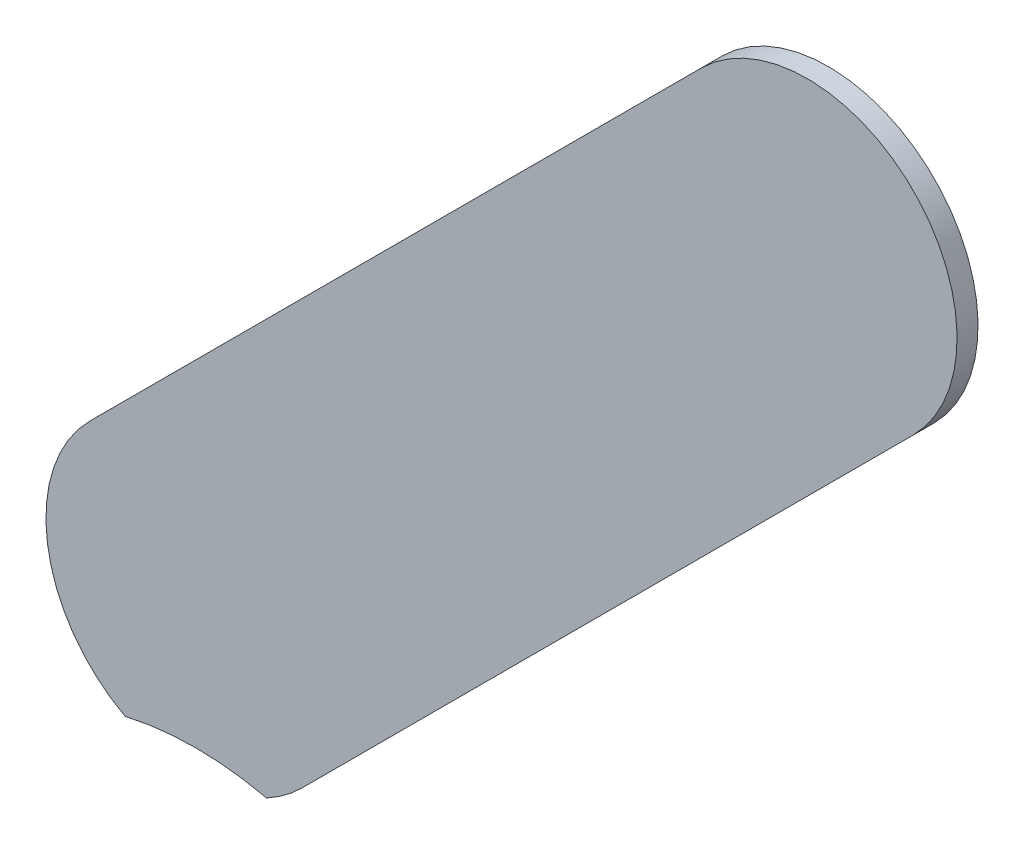
ISO-10303-21;
HEADER;
FILE_DESCRIPTION(('STEP AP214'),'2;1');
FILE_NAME('part.step','',(''),(''),'','','');
FILE_SCHEMA(('AUTOMOTIVE_DESIGN { 1 0 10303 214 1 1 1 1 }'));
ENDSEC;
DATA;
#1=APPLICATION_CONTEXT('core data for automotive mechanical design processes');
#2=APPLICATION_PROTOCOL_DEFINITION('international standard','automotive_design',2000,#1);
#3=PRODUCT_CONTEXT('',#1,'mechanical');
#4=PRODUCT('Part','Part','',(#3));
#5=PRODUCT_RELATED_PRODUCT_CATEGORY('part','',(#4));
#6=PRODUCT_DEFINITION_FORMATION('','',#4);
#7=PRODUCT_DEFINITION_CONTEXT('part definition',#1,'design');
#8=PRODUCT_DEFINITION('design','',#6,#7);
#9=PRODUCT_DEFINITION_SHAPE('','',#8);
#10=(LENGTH_UNIT() NAMED_UNIT(*) SI_UNIT(.MILLI.,.METRE.));
#11=(NAMED_UNIT(*) PLANE_ANGLE_UNIT() SI_UNIT($,.RADIAN.));
#12=(NAMED_UNIT(*) SI_UNIT($,.STERADIAN.) SOLID_ANGLE_UNIT());
#13=UNCERTAINTY_MEASURE_WITH_UNIT(LENGTH_MEASURE(1.E-05),#10,'distance_accuracy_value','');
#14=(GEOMETRIC_REPRESENTATION_CONTEXT(3) GLOBAL_UNCERTAINTY_ASSIGNED_CONTEXT((#13)) GLOBAL_UNIT_ASSIGNED_CONTEXT((#10,
#11,#12)) REPRESENTATION_CONTEXT('',''));
#15=CARTESIAN_POINT('',(0.,0.,0.));
#16=DIRECTION('',(0.,0.,1.));
#17=DIRECTION('',(1.,0.,0.));
#18=AXIS2_PLACEMENT_3D('',#15,#16,#17);
#19=CARTESIAN_POINT('',(136.9019995,-111.0019995,-0.035));
#20=DIRECTION('',(0.,0.,-1.));
#21=DIRECTION('',(-0.707106781186548,0.707106781186548,0.));
#22=AXIS2_PLACEMENT_3D('',#19,#20,#21);
#23=CYLINDRICAL_SURFACE('',#22,0.249999723809);
#24=DIRECTION('',(0.,0.,-1.));
#25=VECTOR('',#24,1.);
#26=CARTESIAN_POINT('',(136.78404401306,-111.2224226498,-0.035));
#27=LINE('',#26,#25);
#28=CARTESIAN_POINT('',(136.78404401308,-111.2224226499,0.));
#29=VERTEX_POINT('',#28);
#30=CARTESIAN_POINT('',(136.78404401308,-111.2224226499,-0.035));
#31=VERTEX_POINT('',#30);
#32=EDGE_CURVE('E27',#29,#31,#27,.T.);
#33=ORIENTED_EDGE('',*,*,#32,.F.);
#34=CARTESIAN_POINT('',(136.9019995,-111.0019995,0.));
#35=DIRECTION('',(0.,0.,1.));
#36=DIRECTION('',(-0.707106781186548,0.707106781186548,0.));
#37=AXIS2_PLACEMENT_3D('',#34,#35,#36);
#38=CIRCLE('',#37,0.249999723809);
#39=CARTESIAN_POINT('',(136.725223,-110.825223,0.));
#40=VERTEX_POINT('',#39);
#41=EDGE_CURVE('E135',#40,#29,#38,.T.);
#42=ORIENTED_EDGE('',*,*,#41,.F.);
#43=DIRECTION('',(0.,0.,1.));
#44=VECTOR('',#43,1.);
#45=CARTESIAN_POINT('',(136.725223,-110.825223,-0.035));
#46=LINE('',#45,#44);
#47=CARTESIAN_POINT('',(136.725223,-110.825223,-0.035));
#48=VERTEX_POINT('',#47);
#49=EDGE_CURVE('E11',#48,#40,#46,.T.);
#50=ORIENTED_EDGE('',*,*,#49,.F.);
#51=CARTESIAN_POINT('',(136.9019995,-111.0019995,-0.035));
#52=DIRECTION('',(0.,0.,1.));
#53=DIRECTION('',(-0.707106781186548,0.707106781186548,0.));
#54=AXIS2_PLACEMENT_3D('',#51,#52,#53);
#55=CIRCLE('',#54,0.249999723809);
#56=EDGE_CURVE('E152',#48,#31,#55,.T.);
#57=ORIENTED_EDGE('',*,*,#56,.T.);
#58=EDGE_LOOP('',(#33,#42,#50,#57));
#59=FACE_BOUND('',#58,.T.);
#60=ADVANCED_FACE('F17',(#59),#23,.T.);
#61=CARTESIAN_POINT('',(137.745223,-109.805223,-0.035));
#62=DIRECTION('',(0.707106781186548,-0.707106781186548,0.));
#63=DIRECTION('',(0.,0.,-1.));
#64=AXIS2_PLACEMENT_3D('',#61,#62,#63);
#65=PLANE('',#64);
#66=DIRECTION('',(-0.707106781186548,-0.707106781186548,0.));
#67=VECTOR('',#66,1.);
#68=CARTESIAN_POINT('',(137.745223,-109.805223,-0.035));
#69=LINE('',#68,#67);
#70=CARTESIAN_POINT('',(137.745223,-109.805223,-0.035));
#71=VERTEX_POINT('',#70);
#72=EDGE_CURVE('E136',#71,#48,#69,.T.);
#73=ORIENTED_EDGE('',*,*,#72,.T.);
#74=ORIENTED_EDGE('',*,*,#49,.T.);
#75=DIRECTION('',(-0.707106781186548,-0.707106781186548,0.));
#76=VECTOR('',#75,1.);
#77=CARTESIAN_POINT('',(137.745223,-109.805223,0.));
#78=LINE('',#77,#76);
#79=CARTESIAN_POINT('',(137.745223,-109.805223,0.));
#80=VERTEX_POINT('',#79);
#81=EDGE_CURVE('E132',#80,#40,#78,.T.);
#82=ORIENTED_EDGE('',*,*,#81,.F.);
#83=DIRECTION('',(0.,0.,1.));
#84=VECTOR('',#83,1.);
#85=CARTESIAN_POINT('',(137.745223,-109.805223,-0.035));
#86=LINE('',#85,#84);
#87=EDGE_CURVE('E129',#71,#80,#86,.T.);
#88=ORIENTED_EDGE('',*,*,#87,.F.);
#89=EDGE_LOOP('',(#73,#74,#82,#88));
#90=FACE_BOUND('',#89,.T.);
#91=ADVANCED_FACE('F19',(#90),#65,.F.);
#92=CARTESIAN_POINT('',(136.902,-111.734,-0.045));
#93=DIRECTION('',(0.,0.,-1.));
#94=DIRECTION('',(0.,-1.,0.));
#95=AXIS2_PLACEMENT_3D('',#92,#93,#94);
#96=CYLINDRICAL_SURFACE('',#95,0.525);
#97=DIRECTION('',(0.,0.,-1.));
#98=VECTOR('',#97,1.);
#99=CARTESIAN_POINT('',(137.01995528805,-111.2224224887,-0.035));
#100=LINE('',#99,#98);
#101=CARTESIAN_POINT('',(137.01995528803,-111.2224224887,0.));
#102=VERTEX_POINT('',#101);
#103=CARTESIAN_POINT('',(137.01995528803,-111.2224224887,-0.035));
#104=VERTEX_POINT('',#103);
#105=EDGE_CURVE('E93',#102,#104,#100,.T.);
#106=ORIENTED_EDGE('',*,*,#105,.F.);
#107=CARTESIAN_POINT('',(136.902,-111.734,0.));
#108=DIRECTION('',(0.,0.,-1.));
#109=DIRECTION('',(0.,-1.,0.));
#110=AXIS2_PLACEMENT_3D('',#107,#108,#109);
#111=CIRCLE('',#110,0.525);
#112=EDGE_CURVE('E144',#29,#102,#111,.T.);
#113=ORIENTED_EDGE('',*,*,#112,.F.);
#114=ORIENTED_EDGE('',*,*,#32,.T.);
#115=CARTESIAN_POINT('',(136.902,-111.734,-0.035));
#116=DIRECTION('',(0.,0.,-1.));
#117=DIRECTION('',(0.,-1.,0.));
#118=AXIS2_PLACEMENT_3D('',#115,#116,#117);
#119=CIRCLE('',#118,0.525);
#120=EDGE_CURVE('E128',#31,#104,#119,.T.);
#121=ORIENTED_EDGE('',*,*,#120,.T.);
#122=EDGE_LOOP('',(#106,#113,#114,#121));
#123=FACE_BOUND('',#122,.T.);
#124=ADVANCED_FACE('F223',(#123),#96,.F.);
#125=CARTESIAN_POINT('',(137.078776,-111.178776,0.));
#126=DIRECTION('',(0.,0.,1.));
#127=DIRECTION('',(1.,0.,0.));
#128=AXIS2_PLACEMENT_3D('',#125,#126,#127);
#129=PLANE('',#128);
#130=CARTESIAN_POINT('',(136.9019995,-111.0019995,0.));
#131=DIRECTION('',(0.,0.,1.));
#132=DIRECTION('',(-0.707106781186548,0.707106781186548,0.));
#133=AXIS2_PLACEMENT_3D('',#130,#131,#132);
#134=CIRCLE('',#133,0.249999723809);
#135=CARTESIAN_POINT('',(137.078776,-111.178776,0.));
#136=VERTEX_POINT('',#135);
#137=EDGE_CURVE('E108',#102,#136,#134,.T.);
#138=ORIENTED_EDGE('',*,*,#137,.T.);
#139=DIRECTION('',(0.707106781186548,0.707106781186548,0.));
#140=VECTOR('',#139,1.);
#141=CARTESIAN_POINT('',(137.078776,-111.178776,0.));
#142=LINE('',#141,#140);
#143=CARTESIAN_POINT('',(138.098776,-110.158776,0.));
#144=VERTEX_POINT('',#143);
#145=EDGE_CURVE('E106',#136,#144,#142,.T.);
#146=ORIENTED_EDGE('',*,*,#145,.T.);
#147=CARTESIAN_POINT('',(137.9219995,-109.9819995,0.));
#148=DIRECTION('',(0.,0.,1.));
#149=DIRECTION('',(0.707106781186548,-0.707106781186548,0.));
#150=AXIS2_PLACEMENT_3D('',#147,#148,#149);
#151=CIRCLE('',#150,0.249999723809);
#152=EDGE_CURVE('E124',#144,#80,#151,.T.);
#153=ORIENTED_EDGE('',*,*,#152,.T.);
#154=ORIENTED_EDGE('',*,*,#81,.T.);
#155=ORIENTED_EDGE('',*,*,#41,.T.);
#156=ORIENTED_EDGE('',*,*,#112,.T.);
#157=EDGE_LOOP('',(#138,#146,#153,#154,#155,#156));
#158=FACE_BOUND('',#157,.T.);
#159=ADVANCED_FACE('F215',(#158),#129,.T.);
#160=CARTESIAN_POINT('',(137.078776,-111.178776,-0.035));
#161=DIRECTION('',(0.,0.,1.));
#162=DIRECTION('',(1.,0.,0.));
#163=AXIS2_PLACEMENT_3D('',#160,#161,#162);
#164=PLANE('',#163);
#165=ORIENTED_EDGE('',*,*,#120,.F.);
#166=ORIENTED_EDGE('',*,*,#56,.F.);
#167=ORIENTED_EDGE('',*,*,#72,.F.);
#168=CARTESIAN_POINT('',(137.9219995,-109.9819995,-0.035));
#169=DIRECTION('',(0.,0.,1.));
#170=DIRECTION('',(0.707106781186548,-0.707106781186548,0.));
#171=AXIS2_PLACEMENT_3D('',#168,#169,#170);
#172=CIRCLE('',#171,0.249999723809);
#173=CARTESIAN_POINT('',(138.098776,-110.158776,-0.035));
#174=VERTEX_POINT('',#173);
#175=EDGE_CURVE('E98',#174,#71,#172,.T.);
#176=ORIENTED_EDGE('',*,*,#175,.F.);
#177=DIRECTION('',(0.707106781186548,0.707106781186548,0.));
#178=VECTOR('',#177,1.);
#179=CARTESIAN_POINT('',(137.078776,-111.178776,-0.035));
#180=LINE('',#179,#178);
#181=CARTESIAN_POINT('',(137.078776,-111.178776,-0.035));
#182=VERTEX_POINT('',#181);
#183=EDGE_CURVE('E104',#182,#174,#180,.T.);
#184=ORIENTED_EDGE('',*,*,#183,.F.);
#185=CARTESIAN_POINT('',(136.9019995,-111.0019995,-0.035));
#186=DIRECTION('',(0.,0.,1.));
#187=DIRECTION('',(-0.707106781186548,0.707106781186548,0.));
#188=AXIS2_PLACEMENT_3D('',#185,#186,#187);
#189=CIRCLE('',#188,0.249999723809);
#190=EDGE_CURVE('E86',#104,#182,#189,.T.);
#191=ORIENTED_EDGE('',*,*,#190,.F.);
#192=EDGE_LOOP('',(#165,#166,#167,#176,#184,#191));
#193=FACE_BOUND('',#192,.T.);
#194=ADVANCED_FACE('F110',(#193),#164,.F.);
#195=CARTESIAN_POINT('',(137.9219995,-109.9819995,-0.035));
#196=DIRECTION('',(0.,0.,-1.));
#197=DIRECTION('',(0.707106781186548,-0.707106781186548,0.));
#198=AXIS2_PLACEMENT_3D('',#195,#196,#197);
#199=CYLINDRICAL_SURFACE('',#198,0.249999723809);
#200=ORIENTED_EDGE('',*,*,#175,.T.);
#201=ORIENTED_EDGE('',*,*,#87,.T.);
#202=ORIENTED_EDGE('',*,*,#152,.F.);
#203=DIRECTION('',(0.,0.,1.));
#204=VECTOR('',#203,1.);
#205=CARTESIAN_POINT('',(138.098776,-110.158776,-0.035));
#206=LINE('',#205,#204);
#207=EDGE_CURVE('E115',#174,#144,#206,.T.);
#208=ORIENTED_EDGE('',*,*,#207,.F.);
#209=EDGE_LOOP('',(#200,#201,#202,#208));
#210=FACE_BOUND('',#209,.T.);
#211=ADVANCED_FACE('F228',(#210),#199,.T.);
#212=CARTESIAN_POINT('',(136.9019995,-111.0019995,-0.035));
#213=DIRECTION('',(0.,0.,-1.));
#214=DIRECTION('',(-0.707106781186548,0.707106781186548,0.));
#215=AXIS2_PLACEMENT_3D('',#212,#213,#214);
#216=CYLINDRICAL_SURFACE('',#215,0.249999723809);
#217=DIRECTION('',(0.,0.,1.));
#218=VECTOR('',#217,1.);
#219=CARTESIAN_POINT('',(137.078776,-111.178776,-0.035));
#220=LINE('',#219,#218);
#221=EDGE_CURVE('E90',#182,#136,#220,.T.);
#222=ORIENTED_EDGE('',*,*,#221,.T.);
#223=ORIENTED_EDGE('',*,*,#137,.F.);
#224=ORIENTED_EDGE('',*,*,#105,.T.);
#225=ORIENTED_EDGE('',*,*,#190,.T.);
#226=EDGE_LOOP('',(#222,#223,#224,#225));
#227=FACE_BOUND('',#226,.T.);
#228=ADVANCED_FACE('F88',(#227),#216,.T.);
#229=CARTESIAN_POINT('',(137.078776,-111.178776,-0.035));
#230=DIRECTION('',(-0.707106781186548,0.707106781186548,0.));
#231=DIRECTION('',(0.,0.,1.));
#232=AXIS2_PLACEMENT_3D('',#229,#230,#231);
#233=PLANE('',#232);
#234=ORIENTED_EDGE('',*,*,#183,.T.);
#235=ORIENTED_EDGE('',*,*,#207,.T.);
#236=ORIENTED_EDGE('',*,*,#145,.F.);
#237=ORIENTED_EDGE('',*,*,#221,.F.);
#238=EDGE_LOOP('',(#234,#235,#236,#237));
#239=FACE_BOUND('',#238,.T.);
#240=ADVANCED_FACE('F102',(#239),#233,.F.);
#241=CLOSED_SHELL('',(#60,#91,#124,#159,#194,#211,#228,#240));
#242=MANIFOLD_SOLID_BREP('B1',#241);
#243=ADVANCED_BREP_SHAPE_REPRESENTATION('',(#18,#242),#14);
#244=SHAPE_DEFINITION_REPRESENTATION(#9,#243);
ENDSEC;
END-ISO-10303-21;
